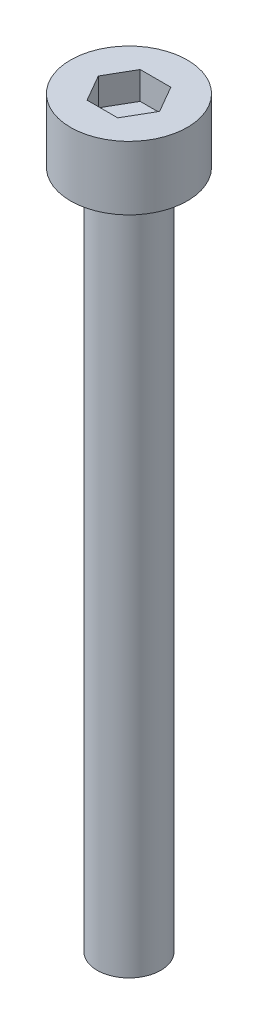
ISO-10303-21;
HEADER;
FILE_DESCRIPTION(('STEP AP214'),'2;1');
FILE_NAME('part.step','',(''),(''),'','','');
FILE_SCHEMA(('AUTOMOTIVE_DESIGN { 1 0 10303 214 1 1 1 1 }'));
ENDSEC;
DATA;
#1=APPLICATION_CONTEXT('core data for automotive mechanical design processes');
#2=APPLICATION_PROTOCOL_DEFINITION('international standard','automotive_design',2000,#1);
#3=PRODUCT_CONTEXT('',#1,'mechanical');
#4=PRODUCT('Part','Part','',(#3));
#5=PRODUCT_RELATED_PRODUCT_CATEGORY('part','',(#4));
#6=PRODUCT_DEFINITION_FORMATION('','',#4);
#7=PRODUCT_DEFINITION_CONTEXT('part definition',#1,'design');
#8=PRODUCT_DEFINITION('design','',#6,#7);
#9=PRODUCT_DEFINITION_SHAPE('','',#8);
#10=(LENGTH_UNIT() NAMED_UNIT(*) SI_UNIT(.MILLI.,.METRE.));
#11=(NAMED_UNIT(*) PLANE_ANGLE_UNIT() SI_UNIT($,.RADIAN.));
#12=(NAMED_UNIT(*) SI_UNIT($,.STERADIAN.) SOLID_ANGLE_UNIT());
#13=UNCERTAINTY_MEASURE_WITH_UNIT(LENGTH_MEASURE(1.E-05),#10,'distance_accuracy_value','');
#14=(GEOMETRIC_REPRESENTATION_CONTEXT(3) GLOBAL_UNCERTAINTY_ASSIGNED_CONTEXT((#13)) GLOBAL_UNIT_ASSIGNED_CONTEXT((#10,
#11,#12)) REPRESENTATION_CONTEXT('',''));
#15=CARTESIAN_POINT('',(0.,0.,0.));
#16=DIRECTION('',(0.,0.,1.));
#17=DIRECTION('',(1.,0.,0.));
#18=AXIS2_PLACEMENT_3D('',#15,#16,#17);
#19=CARTESIAN_POINT('',(0.,3.,0.));
#20=DIRECTION('',(0.,-1.,0.));
#21=DIRECTION('',(0.,0.,-1.));
#22=AXIS2_PLACEMENT_3D('',#19,#20,#21);
#23=CYLINDRICAL_SURFACE('',#22,2.75);
#24=CARTESIAN_POINT('',(0.,3.,0.));
#25=DIRECTION('',(0.,1.,0.));
#26=DIRECTION('',(0.,0.,1.));
#27=AXIS2_PLACEMENT_3D('',#24,#25,#26);
#28=CIRCLE('',#27,2.75);
#29=CARTESIAN_POINT('',(0.,3.,2.75));
#30=VERTEX_POINT('',#29);
#31=EDGE_CURVE('E47',#30,#30,#28,.T.);
#32=ORIENTED_EDGE('',*,*,#31,.F.);
#33=EDGE_LOOP('',(#32));
#34=FACE_BOUND('',#33,.T.);
#35=CARTESIAN_POINT('',(0.,0.,0.));
#36=DIRECTION('',(0.,1.,0.));
#37=DIRECTION('',(0.,0.,1.));
#38=AXIS2_PLACEMENT_3D('',#35,#36,#37);
#39=CIRCLE('',#38,2.75);
#40=CARTESIAN_POINT('',(0.,0.,2.75));
#41=VERTEX_POINT('',#40);
#42=EDGE_CURVE('E42',#41,#41,#39,.T.);
#43=ORIENTED_EDGE('',*,*,#42,.T.);
#44=EDGE_LOOP('',(#43));
#45=FACE_BOUND('',#44,.T.);
#46=ADVANCED_FACE('F39',(#34,#45),#23,.T.);
#47=CARTESIAN_POINT('',(0.,3.,0.));
#48=DIRECTION('',(0.,1.,0.));
#49=DIRECTION('',(0.,0.,1.));
#50=AXIS2_PLACEMENT_3D('',#47,#48,#49);
#51=PLANE('',#50);
#52=DIRECTION('',(0.5,0.,-0.866025403784439));
#53=VECTOR('',#52,1.);
#54=CARTESIAN_POINT('',(0.721687836487032,3.,1.25));
#55=LINE('',#54,#53);
#56=CARTESIAN_POINT('',(0.721687836487032,3.,1.25));
#57=VERTEX_POINT('',#56);
#58=CARTESIAN_POINT('',(1.44337567297406,3.,0.));
#59=VERTEX_POINT('',#58);
#60=EDGE_CURVE('E55',#57,#59,#55,.T.);
#61=ORIENTED_EDGE('',*,*,#60,.F.);
#62=DIRECTION('',(1.,0.,0.));
#63=VECTOR('',#62,1.);
#64=CARTESIAN_POINT('',(-0.721687836487033,3.,1.25));
#65=LINE('',#64,#63);
#66=CARTESIAN_POINT('',(-0.721687836487033,3.,1.25));
#67=VERTEX_POINT('',#66);
#68=EDGE_CURVE('E139',#67,#57,#65,.T.);
#69=ORIENTED_EDGE('',*,*,#68,.F.);
#70=DIRECTION('',(0.5,0.,0.866025403784439));
#71=VECTOR('',#70,1.);
#72=CARTESIAN_POINT('',(-1.44337567297407,3.,0.));
#73=LINE('',#72,#71);
#74=CARTESIAN_POINT('',(-1.44337567297407,3.,0.));
#75=VERTEX_POINT('',#74);
#76=EDGE_CURVE('E137',#75,#67,#73,.T.);
#77=ORIENTED_EDGE('',*,*,#76,.F.);
#78=DIRECTION('',(-0.5,0.,0.866025403784438));
#79=VECTOR('',#78,1.);
#80=CARTESIAN_POINT('',(-0.721687836487033,3.,-1.25));
#81=LINE('',#80,#79);
#82=CARTESIAN_POINT('',(-0.721687836487033,3.,-1.25));
#83=VERTEX_POINT('',#82);
#84=EDGE_CURVE('E103',#83,#75,#81,.T.);
#85=ORIENTED_EDGE('',*,*,#84,.F.);
#86=DIRECTION('',(-1.,0.,0.));
#87=VECTOR('',#86,1.);
#88=CARTESIAN_POINT('',(0.721687836487032,3.,-1.25));
#89=LINE('',#88,#87);
#90=CARTESIAN_POINT('',(0.721687836487032,3.,-1.25));
#91=VERTEX_POINT('',#90);
#92=EDGE_CURVE('E133',#91,#83,#89,.T.);
#93=ORIENTED_EDGE('',*,*,#92,.F.);
#94=DIRECTION('',(-0.5,0.,-0.866025403784439));
#95=VECTOR('',#94,1.);
#96=CARTESIAN_POINT('',(1.44337567297406,3.,0.));
#97=LINE('',#96,#95);
#98=EDGE_CURVE('E129',#59,#91,#97,.T.);
#99=ORIENTED_EDGE('',*,*,#98,.F.);
#100=EDGE_LOOP('',(#61,#69,#77,#85,#93,#99));
#101=FACE_BOUND('',#100,.T.);
#102=ORIENTED_EDGE('',*,*,#31,.T.);
#103=EDGE_LOOP('',(#102));
#104=FACE_BOUND('',#103,.T.);
#105=ADVANCED_FACE('F157',(#101,#104),#51,.T.);
#106=CARTESIAN_POINT('',(0.,0.,0.));
#107=DIRECTION('',(0.,1.,0.));
#108=DIRECTION('',(0.,0.,1.));
#109=AXIS2_PLACEMENT_3D('',#106,#107,#108);
#110=PLANE('',#109);
#111=CARTESIAN_POINT('',(0.,0.,0.));
#112=DIRECTION('',(0.,-1.,0.));
#113=DIRECTION('',(0.,0.,-1.));
#114=AXIS2_PLACEMENT_3D('',#111,#112,#113);
#115=CIRCLE('',#114,1.5);
#116=CARTESIAN_POINT('',(0.,0.,-1.5));
#117=VERTEX_POINT('',#116);
#118=EDGE_CURVE('E11',#117,#117,#115,.T.);
#119=ORIENTED_EDGE('',*,*,#118,.F.);
#120=EDGE_LOOP('',(#119));
#121=FACE_BOUND('',#120,.T.);
#122=ORIENTED_EDGE('',*,*,#42,.F.);
#123=EDGE_LOOP('',(#122));
#124=FACE_BOUND('',#123,.T.);
#125=ADVANCED_FACE('F154',(#121,#124),#110,.F.);
#126=CARTESIAN_POINT('',(0.721687836487032,1.7,1.25));
#127=DIRECTION('',(0.866025403784439,0.,0.5));
#128=DIRECTION('',(0.5,0.,-0.866025403784439));
#129=AXIS2_PLACEMENT_3D('',#126,#127,#128);
#130=PLANE('',#129);
#131=ORIENTED_EDGE('',*,*,#60,.T.);
#132=DIRECTION('',(0.,1.,0.));
#133=VECTOR('',#132,1.);
#134=CARTESIAN_POINT('',(1.44337567297406,1.7,0.));
#135=LINE('',#134,#133);
#136=CARTESIAN_POINT('',(1.44337567297406,1.7,0.));
#137=VERTEX_POINT('',#136);
#138=EDGE_CURVE('E85',#137,#59,#135,.T.);
#139=ORIENTED_EDGE('',*,*,#138,.F.);
#140=DIRECTION('',(0.5,0.,-0.866025403784439));
#141=VECTOR('',#140,1.);
#142=CARTESIAN_POINT('',(0.721687836487032,1.7,1.25));
#143=LINE('',#142,#141);
#144=CARTESIAN_POINT('',(0.721687836487032,1.7,1.25));
#145=VERTEX_POINT('',#144);
#146=EDGE_CURVE('E141',#145,#137,#143,.T.);
#147=ORIENTED_EDGE('',*,*,#146,.F.);
#148=DIRECTION('',(0.,1.,0.));
#149=VECTOR('',#148,1.);
#150=CARTESIAN_POINT('',(0.721687836487032,1.7,1.25));
#151=LINE('',#150,#149);
#152=EDGE_CURVE('E63',#145,#57,#151,.T.);
#153=ORIENTED_EDGE('',*,*,#152,.T.);
#154=EDGE_LOOP('',(#131,#139,#147,#153));
#155=FACE_BOUND('',#154,.T.);
#156=ADVANCED_FACE('F156',(#155),#130,.F.);
#157=CARTESIAN_POINT('',(-0.721687836487033,1.7,1.25));
#158=DIRECTION('',(0.,0.,1.));
#159=DIRECTION('',(1.,0.,0.));
#160=AXIS2_PLACEMENT_3D('',#157,#158,#159);
#161=PLANE('',#160);
#162=ORIENTED_EDGE('',*,*,#68,.T.);
#163=ORIENTED_EDGE('',*,*,#152,.F.);
#164=DIRECTION('',(1.,0.,0.));
#165=VECTOR('',#164,1.);
#166=CARTESIAN_POINT('',(-0.721687836487033,1.7,1.25));
#167=LINE('',#166,#165);
#168=CARTESIAN_POINT('',(-0.721687836487033,1.7,1.25));
#169=VERTEX_POINT('',#168);
#170=EDGE_CURVE('E115',#169,#145,#167,.T.);
#171=ORIENTED_EDGE('',*,*,#170,.F.);
#172=DIRECTION('',(0.,1.,0.));
#173=VECTOR('',#172,1.);
#174=CARTESIAN_POINT('',(-0.721687836487033,1.7,1.25));
#175=LINE('',#174,#173);
#176=EDGE_CURVE('E107',#169,#67,#175,.T.);
#177=ORIENTED_EDGE('',*,*,#176,.T.);
#178=EDGE_LOOP('',(#162,#163,#171,#177));
#179=FACE_BOUND('',#178,.T.);
#180=ADVANCED_FACE('F163',(#179),#161,.F.);
#181=CARTESIAN_POINT('',(-1.44337567297407,1.7,0.));
#182=DIRECTION('',(-0.866025403784439,0.,0.5));
#183=DIRECTION('',(0.5,0.,0.866025403784439));
#184=AXIS2_PLACEMENT_3D('',#181,#182,#183);
#185=PLANE('',#184);
#186=ORIENTED_EDGE('',*,*,#76,.T.);
#187=ORIENTED_EDGE('',*,*,#176,.F.);
#188=DIRECTION('',(0.5,0.,0.866025403784439));
#189=VECTOR('',#188,1.);
#190=CARTESIAN_POINT('',(-1.44337567297407,1.7,0.));
#191=LINE('',#190,#189);
#192=CARTESIAN_POINT('',(-1.44337567297407,1.7,0.));
#193=VERTEX_POINT('',#192);
#194=EDGE_CURVE('E111',#193,#169,#191,.T.);
#195=ORIENTED_EDGE('',*,*,#194,.F.);
#196=DIRECTION('',(0.,1.,0.));
#197=VECTOR('',#196,1.);
#198=CARTESIAN_POINT('',(-1.44337567297407,1.7,0.));
#199=LINE('',#198,#197);
#200=EDGE_CURVE('E96',#193,#75,#199,.T.);
#201=ORIENTED_EDGE('',*,*,#200,.T.);
#202=EDGE_LOOP('',(#186,#187,#195,#201));
#203=FACE_BOUND('',#202,.T.);
#204=ADVANCED_FACE('F112',(#203),#185,.F.);
#205=CARTESIAN_POINT('',(-0.721687836487033,1.7,-1.25));
#206=DIRECTION('',(-0.866025403784439,0.,-0.5));
#207=DIRECTION('',(-0.5,0.,0.866025403784439));
#208=AXIS2_PLACEMENT_3D('',#205,#206,#207);
#209=PLANE('',#208);
#210=ORIENTED_EDGE('',*,*,#84,.T.);
#211=ORIENTED_EDGE('',*,*,#200,.F.);
#212=DIRECTION('',(-0.5,0.,0.866025403784438));
#213=VECTOR('',#212,1.);
#214=CARTESIAN_POINT('',(-0.721687836487033,1.7,-1.25));
#215=LINE('',#214,#213);
#216=CARTESIAN_POINT('',(-0.721687836487033,1.7,-1.25));
#217=VERTEX_POINT('',#216);
#218=EDGE_CURVE('E100',#217,#193,#215,.T.);
#219=ORIENTED_EDGE('',*,*,#218,.F.);
#220=DIRECTION('',(0.,1.,0.));
#221=VECTOR('',#220,1.);
#222=CARTESIAN_POINT('',(-0.721687836487033,1.7,-1.25));
#223=LINE('',#222,#221);
#224=EDGE_CURVE('E108',#217,#83,#223,.T.);
#225=ORIENTED_EDGE('',*,*,#224,.T.);
#226=EDGE_LOOP('',(#210,#211,#219,#225));
#227=FACE_BOUND('',#226,.T.);
#228=ADVANCED_FACE('F98',(#227),#209,.F.);
#229=CARTESIAN_POINT('',(0.721687836487032,1.7,-1.25));
#230=DIRECTION('',(0.,0.,-1.));
#231=DIRECTION('',(-1.,0.,0.));
#232=AXIS2_PLACEMENT_3D('',#229,#230,#231);
#233=PLANE('',#232);
#234=ORIENTED_EDGE('',*,*,#92,.T.);
#235=ORIENTED_EDGE('',*,*,#224,.F.);
#236=DIRECTION('',(-1.,0.,0.));
#237=VECTOR('',#236,1.);
#238=CARTESIAN_POINT('',(0.721687836487032,1.7,-1.25));
#239=LINE('',#238,#237);
#240=CARTESIAN_POINT('',(0.721687836487032,1.7,-1.25));
#241=VERTEX_POINT('',#240);
#242=EDGE_CURVE('E121',#241,#217,#239,.T.);
#243=ORIENTED_EDGE('',*,*,#242,.F.);
#244=DIRECTION('',(0.,1.,0.));
#245=VECTOR('',#244,1.);
#246=CARTESIAN_POINT('',(0.721687836487032,1.7,-1.25));
#247=LINE('',#246,#245);
#248=EDGE_CURVE('E145',#241,#91,#247,.T.);
#249=ORIENTED_EDGE('',*,*,#248,.T.);
#250=EDGE_LOOP('',(#234,#235,#243,#249));
#251=FACE_BOUND('',#250,.T.);
#252=ADVANCED_FACE('F208',(#251),#233,.F.);
#253=CARTESIAN_POINT('',(1.44337567297406,1.7,0.));
#254=DIRECTION('',(0.866025403784439,0.,-0.5));
#255=DIRECTION('',(-0.5,0.,-0.866025403784439));
#256=AXIS2_PLACEMENT_3D('',#253,#254,#255);
#257=PLANE('',#256);
#258=ORIENTED_EDGE('',*,*,#98,.T.);
#259=ORIENTED_EDGE('',*,*,#248,.F.);
#260=DIRECTION('',(-0.5,0.,-0.866025403784439));
#261=VECTOR('',#260,1.);
#262=CARTESIAN_POINT('',(1.44337567297406,1.7,0.));
#263=LINE('',#262,#261);
#264=EDGE_CURVE('E123',#137,#241,#263,.T.);
#265=ORIENTED_EDGE('',*,*,#264,.F.);
#266=ORIENTED_EDGE('',*,*,#138,.T.);
#267=EDGE_LOOP('',(#258,#259,#265,#266));
#268=FACE_BOUND('',#267,.T.);
#269=ADVANCED_FACE('F217',(#268),#257,.F.);
#270=CARTESIAN_POINT('',(0.,1.7,0.));
#271=DIRECTION('',(0.,1.,0.));
#272=DIRECTION('',(0.,0.,1.));
#273=AXIS2_PLACEMENT_3D('',#270,#271,#272);
#274=PLANE('',#273);
#275=ORIENTED_EDGE('',*,*,#146,.T.);
#276=ORIENTED_EDGE('',*,*,#264,.T.);
#277=ORIENTED_EDGE('',*,*,#242,.T.);
#278=ORIENTED_EDGE('',*,*,#218,.T.);
#279=ORIENTED_EDGE('',*,*,#194,.T.);
#280=ORIENTED_EDGE('',*,*,#170,.T.);
#281=EDGE_LOOP('',(#275,#276,#277,#278,#279,#280));
#282=FACE_BOUND('',#281,.T.);
#283=ADVANCED_FACE('F118',(#282),#274,.T.);
#284=CARTESIAN_POINT('',(0.,-32.,0.));
#285=DIRECTION('',(0.,1.,0.));
#286=DIRECTION('',(0.,0.,1.));
#287=AXIS2_PLACEMENT_3D('',#284,#285,#286);
#288=CYLINDRICAL_SURFACE('',#287,1.5);
#289=CARTESIAN_POINT('',(0.,-32.,0.));
#290=DIRECTION('',(0.,-1.,0.));
#291=DIRECTION('',(0.,0.,-1.));
#292=AXIS2_PLACEMENT_3D('',#289,#290,#291);
#293=CIRCLE('',#292,1.5);
#294=CARTESIAN_POINT('',(0.,-32.,-1.5));
#295=VERTEX_POINT('',#294);
#296=EDGE_CURVE('E130',#295,#295,#293,.T.);
#297=ORIENTED_EDGE('',*,*,#296,.F.);
#298=EDGE_LOOP('',(#297));
#299=FACE_BOUND('',#298,.T.);
#300=ORIENTED_EDGE('',*,*,#118,.T.);
#301=EDGE_LOOP('',(#300));
#302=FACE_BOUND('',#301,.T.);
#303=ADVANCED_FACE('F235',(#299,#302),#288,.T.);
#304=CARTESIAN_POINT('',(0.,-32.,0.));
#305=DIRECTION('',(0.,-1.,0.));
#306=DIRECTION('',(0.,0.,-1.));
#307=AXIS2_PLACEMENT_3D('',#304,#305,#306);
#308=PLANE('',#307);
#309=ORIENTED_EDGE('',*,*,#296,.T.);
#310=EDGE_LOOP('',(#309));
#311=FACE_BOUND('',#310,.T.);
#312=ADVANCED_FACE('F249',(#311),#308,.T.);
#313=CLOSED_SHELL('',(#46,#105,#125,#156,#180,#204,#228,#252,#269,#283,#303,#312));
#314=MANIFOLD_SOLID_BREP('B2',#313);
#315=ADVANCED_BREP_SHAPE_REPRESENTATION('',(#18,#314),#14);
#316=SHAPE_DEFINITION_REPRESENTATION(#9,#315);
ENDSEC;
END-ISO-10303-21;
